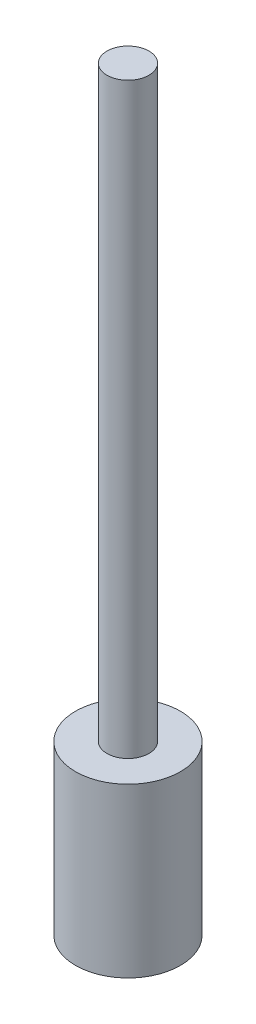
ISO-10303-21;
HEADER;
FILE_DESCRIPTION(('STEP AP214'),'2;1');
FILE_NAME('part.step','',(''),(''),'','','');
FILE_SCHEMA(('AUTOMOTIVE_DESIGN { 1 0 10303 214 1 1 1 1 }'));
ENDSEC;
DATA;
#1=APPLICATION_CONTEXT('core data for automotive mechanical design processes');
#2=APPLICATION_PROTOCOL_DEFINITION('international standard','automotive_design',2000,#1);
#3=PRODUCT_CONTEXT('',#1,'mechanical');
#4=PRODUCT('Part','Part','',(#3));
#5=PRODUCT_RELATED_PRODUCT_CATEGORY('part','',(#4));
#6=PRODUCT_DEFINITION_FORMATION('','',#4);
#7=PRODUCT_DEFINITION_CONTEXT('part definition',#1,'design');
#8=PRODUCT_DEFINITION('design','',#6,#7);
#9=PRODUCT_DEFINITION_SHAPE('','',#8);
#10=(LENGTH_UNIT() NAMED_UNIT(*) SI_UNIT(.MILLI.,.METRE.));
#11=(NAMED_UNIT(*) PLANE_ANGLE_UNIT() SI_UNIT($,.RADIAN.));
#12=(NAMED_UNIT(*) SI_UNIT($,.STERADIAN.) SOLID_ANGLE_UNIT());
#13=UNCERTAINTY_MEASURE_WITH_UNIT(LENGTH_MEASURE(1.E-05),#10,'distance_accuracy_value','');
#14=(GEOMETRIC_REPRESENTATION_CONTEXT(3) GLOBAL_UNCERTAINTY_ASSIGNED_CONTEXT((#13)) GLOBAL_UNIT_ASSIGNED_CONTEXT((#10,
#11,#12)) REPRESENTATION_CONTEXT('',''));
#15=CARTESIAN_POINT('',(0.,0.,0.));
#16=DIRECTION('',(0.,0.,1.));
#17=DIRECTION('',(1.,0.,0.));
#18=AXIS2_PLACEMENT_3D('',#15,#16,#17);
#19=CARTESIAN_POINT('',(0.,40.,0.));
#20=DIRECTION('',(0.,1.,0.));
#21=DIRECTION('',(0.,0.,1.));
#22=AXIS2_PLACEMENT_3D('',#19,#20,#21);
#23=PLANE('',#22);
#24=CARTESIAN_POINT('',(0.,40.,0.));
#25=DIRECTION('',(0.,1.,0.));
#26=DIRECTION('',(0.,0.,1.));
#27=AXIS2_PLACEMENT_3D('',#24,#25,#26);
#28=CIRCLE('',#27,12.5);
#29=CARTESIAN_POINT('',(0.,40.,12.5));
#30=VERTEX_POINT('',#29);
#31=EDGE_CURVE('E10',#30,#30,#28,.T.);
#32=ORIENTED_EDGE('',*,*,#31,.T.);
#33=EDGE_LOOP('',(#32));
#34=FACE_BOUND('',#33,.T.);
#35=CARTESIAN_POINT('',(0.,40.,0.));
#36=DIRECTION('',(0.,1.,0.));
#37=DIRECTION('',(0.,0.,1.));
#38=AXIS2_PLACEMENT_3D('',#35,#36,#37);
#39=CIRCLE('',#38,5.);
#40=CARTESIAN_POINT('',(0.,40.,5.));
#41=VERTEX_POINT('',#40);
#42=EDGE_CURVE('E44',#41,#41,#39,.T.);
#43=ORIENTED_EDGE('',*,*,#42,.F.);
#44=EDGE_LOOP('',(#43));
#45=FACE_BOUND('',#44,.T.);
#46=ADVANCED_FACE('F31',(#34,#45),#23,.T.);
#47=CARTESIAN_POINT('',(0.,40.,0.));
#48=DIRECTION('',(0.,-1.,0.));
#49=DIRECTION('',(0.,0.,-1.));
#50=AXIS2_PLACEMENT_3D('',#47,#48,#49);
#51=CYLINDRICAL_SURFACE('',#50,12.5);
#52=ORIENTED_EDGE('',*,*,#31,.F.);
#53=EDGE_LOOP('',(#52));
#54=FACE_BOUND('',#53,.T.);
#55=CARTESIAN_POINT('',(0.,0.,0.));
#56=DIRECTION('',(0.,1.,0.));
#57=DIRECTION('',(0.,0.,1.));
#58=AXIS2_PLACEMENT_3D('',#55,#56,#57);
#59=CIRCLE('',#58,12.5);
#60=CARTESIAN_POINT('',(0.,0.,12.5));
#61=VERTEX_POINT('',#60);
#62=EDGE_CURVE('E35',#61,#61,#59,.T.);
#63=ORIENTED_EDGE('',*,*,#62,.T.);
#64=EDGE_LOOP('',(#63));
#65=FACE_BOUND('',#64,.T.);
#66=ADVANCED_FACE('F33',(#54,#65),#51,.T.);
#67=CARTESIAN_POINT('',(0.,0.,0.));
#68=DIRECTION('',(0.,1.,0.));
#69=DIRECTION('',(0.,0.,1.));
#70=AXIS2_PLACEMENT_3D('',#67,#68,#69);
#71=PLANE('',#70);
#72=ORIENTED_EDGE('',*,*,#62,.F.);
#73=EDGE_LOOP('',(#72));
#74=FACE_BOUND('',#73,.T.);
#75=ADVANCED_FACE('F55',(#74),#71,.F.);
#76=CARTESIAN_POINT('',(0.,180.,0.));
#77=DIRECTION('',(0.,-1.,0.));
#78=DIRECTION('',(0.,0.,-1.));
#79=AXIS2_PLACEMENT_3D('',#76,#77,#78);
#80=CYLINDRICAL_SURFACE('',#79,5.);
#81=CARTESIAN_POINT('',(0.,180.,0.));
#82=DIRECTION('',(0.,1.,0.));
#83=DIRECTION('',(0.,0.,1.));
#84=AXIS2_PLACEMENT_3D('',#81,#82,#83);
#85=CIRCLE('',#84,5.);
#86=CARTESIAN_POINT('',(0.,180.,5.));
#87=VERTEX_POINT('',#86);
#88=EDGE_CURVE('E42',#87,#87,#85,.T.);
#89=ORIENTED_EDGE('',*,*,#88,.F.);
#90=EDGE_LOOP('',(#89));
#91=FACE_BOUND('',#90,.T.);
#92=ORIENTED_EDGE('',*,*,#42,.T.);
#93=EDGE_LOOP('',(#92));
#94=FACE_BOUND('',#93,.T.);
#95=ADVANCED_FACE('F52',(#91,#94),#80,.T.);
#96=CARTESIAN_POINT('',(0.,180.,0.));
#97=DIRECTION('',(0.,1.,0.));
#98=DIRECTION('',(0.,0.,1.));
#99=AXIS2_PLACEMENT_3D('',#96,#97,#98);
#100=PLANE('',#99);
#101=ORIENTED_EDGE('',*,*,#88,.T.);
#102=EDGE_LOOP('',(#101));
#103=FACE_BOUND('',#102,.T.);
#104=ADVANCED_FACE('F50',(#103),#100,.T.);
#105=CLOSED_SHELL('',(#46,#66,#75,#95,#104));
#106=MANIFOLD_SOLID_BREP('B2',#105);
#107=ADVANCED_BREP_SHAPE_REPRESENTATION('',(#18,#106),#14);
#108=SHAPE_DEFINITION_REPRESENTATION(#9,#107);
ENDSEC;
END-ISO-10303-21;
